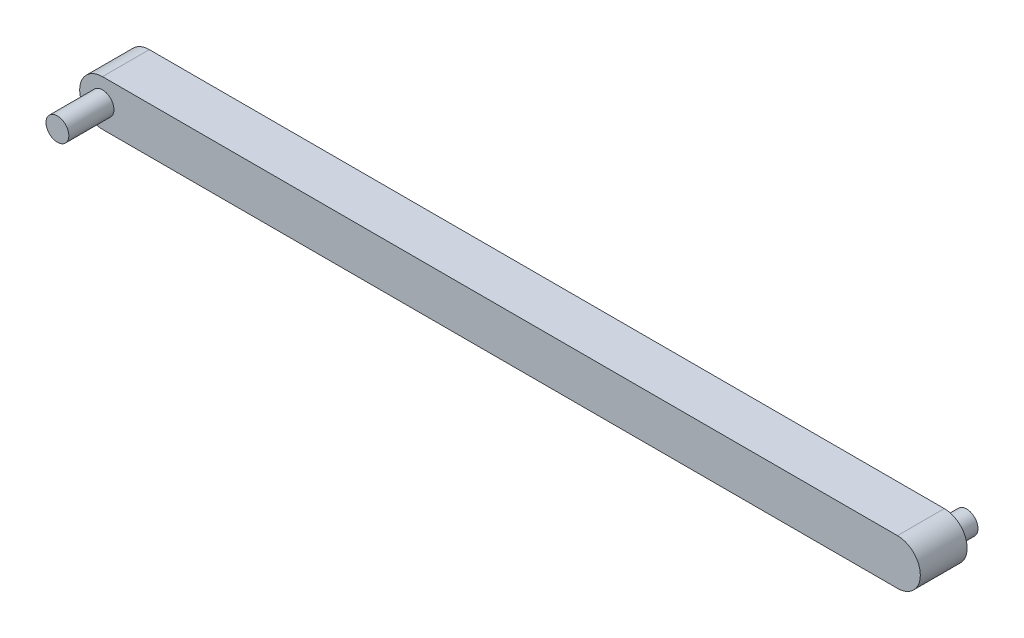
ISO-10303-21;
HEADER;
FILE_DESCRIPTION(('STEP AP214'),'2;1');
FILE_NAME('part.step','',(''),(''),'','','');
FILE_SCHEMA(('AUTOMOTIVE_DESIGN { 1 0 10303 214 1 1 1 1 }'));
ENDSEC;
DATA;
#1=APPLICATION_CONTEXT('core data for automotive mechanical design processes');
#2=APPLICATION_PROTOCOL_DEFINITION('international standard','automotive_design',2000,#1);
#3=PRODUCT_CONTEXT('',#1,'mechanical');
#4=PRODUCT('Part','Part','',(#3));
#5=PRODUCT_RELATED_PRODUCT_CATEGORY('part','',(#4));
#6=PRODUCT_DEFINITION_FORMATION('','',#4);
#7=PRODUCT_DEFINITION_CONTEXT('part definition',#1,'design');
#8=PRODUCT_DEFINITION('design','',#6,#7);
#9=PRODUCT_DEFINITION_SHAPE('','',#8);
#10=(LENGTH_UNIT() NAMED_UNIT(*) SI_UNIT(.MILLI.,.METRE.));
#11=(NAMED_UNIT(*) PLANE_ANGLE_UNIT() SI_UNIT($,.RADIAN.));
#12=(NAMED_UNIT(*) SI_UNIT($,.STERADIAN.) SOLID_ANGLE_UNIT());
#13=UNCERTAINTY_MEASURE_WITH_UNIT(LENGTH_MEASURE(1.E-05),#10,'distance_accuracy_value','');
#14=(GEOMETRIC_REPRESENTATION_CONTEXT(3) GLOBAL_UNCERTAINTY_ASSIGNED_CONTEXT((#13)) GLOBAL_UNIT_ASSIGNED_CONTEXT((#10,
#11,#12)) REPRESENTATION_CONTEXT('',''));
#15=CARTESIAN_POINT('',(0.,0.,0.));
#16=DIRECTION('',(0.,0.,1.));
#17=DIRECTION('',(1.,0.,0.));
#18=AXIS2_PLACEMENT_3D('',#15,#16,#17);
#19=CARTESIAN_POINT('',(-28.7901893616651,1.6030534351145,5.125));
#20=DIRECTION('',(0.,0.,-1.));
#21=DIRECTION('',(-1.,0.,0.));
#22=AXIS2_PLACEMENT_3D('',#19,#20,#21);
#23=CYLINDRICAL_SURFACE('',#22,5.);
#24=CARTESIAN_POINT('',(-28.7901893616651,1.6030534351145,-5.125));
#25=DIRECTION('',(0.,0.,1.));
#26=DIRECTION('',(1.,0.,0.));
#27=AXIS2_PLACEMENT_3D('',#24,#25,#26);
#28=CIRCLE('',#27,5.);
#29=CARTESIAN_POINT('',(-28.7901893616651,6.6030534351145,-5.125));
#30=VERTEX_POINT('',#29);
#31=CARTESIAN_POINT('',(-28.7901893616651,-3.3969465648855,-5.125));
#32=VERTEX_POINT('',#31);
#33=EDGE_CURVE('E110',#30,#32,#28,.T.);
#34=ORIENTED_EDGE('',*,*,#33,.T.);
#35=DIRECTION('',(0.,0.,-1.));
#36=VECTOR('',#35,1.);
#37=CARTESIAN_POINT('',(-28.7901893616651,-3.3969465648855,5.125));
#38=LINE('',#37,#36);
#39=CARTESIAN_POINT('',(-28.7901893616651,-3.3969465648855,5.125));
#40=VERTEX_POINT('',#39);
#41=EDGE_CURVE('E11',#40,#32,#38,.T.);
#42=ORIENTED_EDGE('',*,*,#41,.F.);
#43=CARTESIAN_POINT('',(-28.7901893616651,1.6030534351145,5.125));
#44=DIRECTION('',(0.,0.,1.));
#45=DIRECTION('',(1.,0.,0.));
#46=AXIS2_PLACEMENT_3D('',#43,#44,#45);
#47=CIRCLE('',#46,5.);
#48=CARTESIAN_POINT('',(-28.7901893616651,6.6030534351145,5.125));
#49=VERTEX_POINT('',#48);
#50=EDGE_CURVE('E93',#49,#40,#47,.T.);
#51=ORIENTED_EDGE('',*,*,#50,.F.);
#52=DIRECTION('',(0.,0.,-1.));
#53=VECTOR('',#52,1.);
#54=CARTESIAN_POINT('',(-28.7901893616651,6.6030534351145,5.125));
#55=LINE('',#54,#53);
#56=EDGE_CURVE('E106',#49,#30,#55,.T.);
#57=ORIENTED_EDGE('',*,*,#56,.T.);
#58=EDGE_LOOP('',(#34,#42,#51,#57));
#59=FACE_BOUND('',#58,.T.);
#60=ADVANCED_FACE('F39',(#59),#23,.T.);
#61=CARTESIAN_POINT('',(-28.7901893616651,-3.3969465648855,5.125));
#62=DIRECTION('',(0.,1.,0.));
#63=DIRECTION('',(0.,0.,1.));
#64=AXIS2_PLACEMENT_3D('',#61,#62,#63);
#65=PLANE('',#64);
#66=DIRECTION('',(1.,0.,0.));
#67=VECTOR('',#66,1.);
#68=CARTESIAN_POINT('',(-28.7901893616651,-3.3969465648855,-5.125));
#69=LINE('',#68,#67);
#70=CARTESIAN_POINT('',(145.209810638335,-3.3969465648855,-5.125));
#71=VERTEX_POINT('',#70);
#72=EDGE_CURVE('E98',#32,#71,#69,.T.);
#73=ORIENTED_EDGE('',*,*,#72,.T.);
#74=DIRECTION('',(0.,0.,-1.));
#75=VECTOR('',#74,1.);
#76=CARTESIAN_POINT('',(145.209810638335,-3.3969465648855,5.125));
#77=LINE('',#76,#75);
#78=CARTESIAN_POINT('',(145.209810638335,-3.3969465648855,5.125));
#79=VERTEX_POINT('',#78);
#80=EDGE_CURVE('E49',#79,#71,#77,.T.);
#81=ORIENTED_EDGE('',*,*,#80,.F.);
#82=DIRECTION('',(1.,0.,0.));
#83=VECTOR('',#82,1.);
#84=CARTESIAN_POINT('',(-28.7901893616651,-3.3969465648855,5.125));
#85=LINE('',#84,#83);
#86=EDGE_CURVE('E88',#40,#79,#85,.T.);
#87=ORIENTED_EDGE('',*,*,#86,.F.);
#88=ORIENTED_EDGE('',*,*,#41,.T.);
#89=EDGE_LOOP('',(#73,#81,#87,#88));
#90=FACE_BOUND('',#89,.T.);
#91=ADVANCED_FACE('F97',(#90),#65,.F.);
#92=CARTESIAN_POINT('',(145.209810638335,1.6030534351145,5.125));
#93=DIRECTION('',(0.,0.,-1.));
#94=DIRECTION('',(-1.,0.,0.));
#95=AXIS2_PLACEMENT_3D('',#92,#93,#94);
#96=CYLINDRICAL_SURFACE('',#95,5.);
#97=CARTESIAN_POINT('',(145.209810638335,1.6030534351145,-5.125));
#98=DIRECTION('',(0.,0.,1.));
#99=DIRECTION('',(1.,0.,0.));
#100=AXIS2_PLACEMENT_3D('',#97,#98,#99);
#101=CIRCLE('',#100,5.);
#102=CARTESIAN_POINT('',(145.209810638335,6.6030534351145,-5.125));
#103=VERTEX_POINT('',#102);
#104=EDGE_CURVE('E75',#71,#103,#101,.T.);
#105=ORIENTED_EDGE('',*,*,#104,.T.);
#106=DIRECTION('',(0.,0.,-1.));
#107=VECTOR('',#106,1.);
#108=CARTESIAN_POINT('',(145.209810638335,6.6030534351145,5.125));
#109=LINE('',#108,#107);
#110=CARTESIAN_POINT('',(145.209810638335,6.6030534351145,5.125));
#111=VERTEX_POINT('',#110);
#112=EDGE_CURVE('E100',#111,#103,#109,.T.);
#113=ORIENTED_EDGE('',*,*,#112,.F.);
#114=CARTESIAN_POINT('',(145.209810638335,1.6030534351145,5.125));
#115=DIRECTION('',(0.,0.,1.));
#116=DIRECTION('',(1.,0.,0.));
#117=AXIS2_PLACEMENT_3D('',#114,#115,#116);
#118=CIRCLE('',#117,5.);
#119=EDGE_CURVE('E91',#79,#111,#118,.T.);
#120=ORIENTED_EDGE('',*,*,#119,.F.);
#121=ORIENTED_EDGE('',*,*,#80,.T.);
#122=EDGE_LOOP('',(#105,#113,#120,#121));
#123=FACE_BOUND('',#122,.T.);
#124=ADVANCED_FACE('F102',(#123),#96,.T.);
#125=CARTESIAN_POINT('',(-28.7901893616651,6.6030534351145,5.125));
#126=DIRECTION('',(0.,-1.,0.));
#127=DIRECTION('',(1.,0.,0.));
#128=AXIS2_PLACEMENT_3D('',#125,#126,#127);
#129=PLANE('',#128);
#130=DIRECTION('',(-1.,0.,0.));
#131=VECTOR('',#130,1.);
#132=CARTESIAN_POINT('',(-28.7901893616651,6.6030534351145,-5.125));
#133=LINE('',#132,#131);
#134=EDGE_CURVE('E81',#103,#30,#133,.T.);
#135=ORIENTED_EDGE('',*,*,#134,.T.);
#136=ORIENTED_EDGE('',*,*,#56,.F.);
#137=DIRECTION('',(-1.,0.,0.));
#138=VECTOR('',#137,1.);
#139=CARTESIAN_POINT('',(-28.7901893616651,6.6030534351145,5.125));
#140=LINE('',#139,#138);
#141=EDGE_CURVE('E58',#111,#49,#140,.T.);
#142=ORIENTED_EDGE('',*,*,#141,.F.);
#143=ORIENTED_EDGE('',*,*,#112,.T.);
#144=EDGE_LOOP('',(#135,#136,#142,#143));
#145=FACE_BOUND('',#144,.T.);
#146=ADVANCED_FACE('F172',(#145),#129,.F.);
#147=CARTESIAN_POINT('',(-28.7901893616651,1.6030534351145,5.125));
#148=DIRECTION('',(0.,0.,1.));
#149=DIRECTION('',(1.,0.,0.));
#150=AXIS2_PLACEMENT_3D('',#147,#148,#149);
#151=PLANE('',#150);
#152=CARTESIAN_POINT('',(-28.7901893616651,1.6030534351145,5.125));
#153=DIRECTION('',(0.,0.,1.));
#154=DIRECTION('',(1.,0.,0.));
#155=AXIS2_PLACEMENT_3D('',#152,#153,#154);
#156=CIRCLE('',#155,2.5);
#157=CARTESIAN_POINT('',(-26.2901893616651,1.6030534351145,5.125));
#158=VERTEX_POINT('',#157);
#159=EDGE_CURVE('E114',#158,#158,#156,.F.);
#160=ORIENTED_EDGE('',*,*,#159,.T.);
#161=EDGE_LOOP('',(#160));
#162=FACE_BOUND('',#161,.T.);
#163=ORIENTED_EDGE('',*,*,#50,.T.);
#164=ORIENTED_EDGE('',*,*,#86,.T.);
#165=ORIENTED_EDGE('',*,*,#119,.T.);
#166=ORIENTED_EDGE('',*,*,#141,.T.);
#167=EDGE_LOOP('',(#163,#164,#165,#166));
#168=FACE_BOUND('',#167,.T.);
#169=ADVANCED_FACE('F89',(#162,#168),#151,.T.);
#170=CARTESIAN_POINT('',(-28.7901893616651,1.6030534351145,-5.125));
#171=DIRECTION('',(0.,0.,1.));
#172=DIRECTION('',(1.,0.,0.));
#173=AXIS2_PLACEMENT_3D('',#170,#171,#172);
#174=PLANE('',#173);
#175=CARTESIAN_POINT('',(145.209810638335,1.6030534351145,-5.125));
#176=DIRECTION('',(0.,0.,1.));
#177=DIRECTION('',(1.,0.,0.));
#178=AXIS2_PLACEMENT_3D('',#175,#176,#177);
#179=CIRCLE('',#178,2.5);
#180=CARTESIAN_POINT('',(147.709810638335,1.6030534351145,-5.125));
#181=VERTEX_POINT('',#180);
#182=EDGE_CURVE('E42',#181,#181,#179,.T.);
#183=ORIENTED_EDGE('',*,*,#182,.T.);
#184=EDGE_LOOP('',(#183));
#185=FACE_BOUND('',#184,.T.);
#186=ORIENTED_EDGE('',*,*,#33,.F.);
#187=ORIENTED_EDGE('',*,*,#134,.F.);
#188=ORIENTED_EDGE('',*,*,#104,.F.);
#189=ORIENTED_EDGE('',*,*,#72,.F.);
#190=EDGE_LOOP('',(#186,#187,#188,#189));
#191=FACE_BOUND('',#190,.T.);
#192=ADVANCED_FACE('F161',(#185,#191),#174,.F.);
#193=CARTESIAN_POINT('',(-28.7901893616651,1.6030534351145,15.));
#194=DIRECTION('',(0.,0.,-1.));
#195=DIRECTION('',(-1.,0.,0.));
#196=AXIS2_PLACEMENT_3D('',#193,#194,#195);
#197=CYLINDRICAL_SURFACE('',#196,2.5);
#198=ORIENTED_EDGE('',*,*,#159,.F.);
#199=EDGE_LOOP('',(#198));
#200=FACE_BOUND('',#199,.T.);
#201=CARTESIAN_POINT('',(-28.7901893616651,1.6030534351145,15.));
#202=DIRECTION('',(0.,0.,1.));
#203=DIRECTION('',(1.,0.,0.));
#204=AXIS2_PLACEMENT_3D('',#201,#202,#203);
#205=CIRCLE('',#204,2.5);
#206=CARTESIAN_POINT('',(-26.2901893616651,1.6030534351145,15.));
#207=VERTEX_POINT('',#206);
#208=EDGE_CURVE('E126',#207,#207,#205,.T.);
#209=ORIENTED_EDGE('',*,*,#208,.F.);
#210=EDGE_LOOP('',(#209));
#211=FACE_BOUND('',#210,.T.);
#212=ADVANCED_FACE('F163',(#200,#211),#197,.T.);
#213=CARTESIAN_POINT('',(-28.7901893616651,1.6030534351145,15.));
#214=DIRECTION('',(0.,0.,1.));
#215=DIRECTION('',(1.,0.,0.));
#216=AXIS2_PLACEMENT_3D('',#213,#214,#215);
#217=PLANE('',#216);
#218=ORIENTED_EDGE('',*,*,#208,.T.);
#219=EDGE_LOOP('',(#218));
#220=FACE_BOUND('',#219,.T.);
#221=ADVANCED_FACE('F152',(#220),#217,.T.);
#222=CARTESIAN_POINT('',(145.209810638335,1.6030534351145,-10.));
#223=DIRECTION('',(0.,0.,1.));
#224=DIRECTION('',(1.,0.,0.));
#225=AXIS2_PLACEMENT_3D('',#222,#223,#224);
#226=CYLINDRICAL_SURFACE('',#225,2.5);
#227=CARTESIAN_POINT('',(145.209810638335,1.6030534351145,-10.));
#228=DIRECTION('',(0.,0.,1.));
#229=DIRECTION('',(1.,0.,0.));
#230=AXIS2_PLACEMENT_3D('',#227,#228,#229);
#231=CIRCLE('',#230,2.5);
#232=CARTESIAN_POINT('',(147.709810638335,1.6030534351145,-10.));
#233=VERTEX_POINT('',#232);
#234=EDGE_CURVE('E136',#233,#233,#231,.T.);
#235=ORIENTED_EDGE('',*,*,#234,.T.);
#236=EDGE_LOOP('',(#235));
#237=FACE_BOUND('',#236,.T.);
#238=ORIENTED_EDGE('',*,*,#182,.F.);
#239=EDGE_LOOP('',(#238));
#240=FACE_BOUND('',#239,.T.);
#241=ADVANCED_FACE('F143',(#237,#240),#226,.T.);
#242=CARTESIAN_POINT('',(145.209810638335,1.6030534351145,-10.));
#243=DIRECTION('',(0.,0.,1.));
#244=DIRECTION('',(1.,0.,0.));
#245=AXIS2_PLACEMENT_3D('',#242,#243,#244);
#246=PLANE('',#245);
#247=ORIENTED_EDGE('',*,*,#234,.F.);
#248=EDGE_LOOP('',(#247));
#249=FACE_BOUND('',#248,.T.);
#250=ADVANCED_FACE('F146',(#249),#246,.F.);
#251=CLOSED_SHELL('',(#60,#91,#124,#146,#169,#192,#212,#221,#241,#250));
#252=MANIFOLD_SOLID_BREP('B2',#251);
#253=ADVANCED_BREP_SHAPE_REPRESENTATION('',(#18,#252),#14);
#254=SHAPE_DEFINITION_REPRESENTATION(#9,#253);
ENDSEC;
END-ISO-10303-21;
